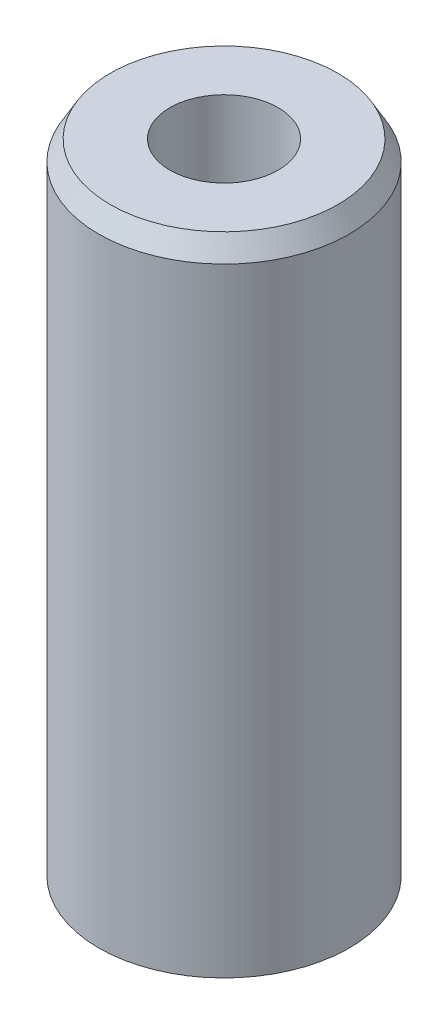
ISO-10303-21;
HEADER;
FILE_DESCRIPTION(('STEP AP214'),'2;1');
FILE_NAME('part.step','',(''),(''),'','','');
FILE_SCHEMA(('AUTOMOTIVE_DESIGN { 1 0 10303 214 1 1 1 1 }'));
ENDSEC;
DATA;
#1=APPLICATION_CONTEXT('core data for automotive mechanical design processes');
#2=APPLICATION_PROTOCOL_DEFINITION('international standard','automotive_design',2000,#1);
#3=PRODUCT_CONTEXT('',#1,'mechanical');
#4=PRODUCT('Part','Part','',(#3));
#5=PRODUCT_RELATED_PRODUCT_CATEGORY('part','',(#4));
#6=PRODUCT_DEFINITION_FORMATION('','',#4);
#7=PRODUCT_DEFINITION_CONTEXT('part definition',#1,'design');
#8=PRODUCT_DEFINITION('design','',#6,#7);
#9=PRODUCT_DEFINITION_SHAPE('','',#8);
#10=(LENGTH_UNIT() NAMED_UNIT(*) SI_UNIT(.MILLI.,.METRE.));
#11=(NAMED_UNIT(*) PLANE_ANGLE_UNIT() SI_UNIT($,.RADIAN.));
#12=(NAMED_UNIT(*) SI_UNIT($,.STERADIAN.) SOLID_ANGLE_UNIT());
#13=UNCERTAINTY_MEASURE_WITH_UNIT(LENGTH_MEASURE(1.E-05),#10,'distance_accuracy_value','');
#14=(GEOMETRIC_REPRESENTATION_CONTEXT(3) GLOBAL_UNCERTAINTY_ASSIGNED_CONTEXT((#13)) GLOBAL_UNIT_ASSIGNED_CONTEXT((#10,
#11,#12)) REPRESENTATION_CONTEXT('',''));
#15=CARTESIAN_POINT('',(0.,0.,0.));
#16=DIRECTION('',(0.,0.,1.));
#17=DIRECTION('',(1.,0.,0.));
#18=AXIS2_PLACEMENT_3D('',#15,#16,#17);
#19=CARTESIAN_POINT('',(0.,51.8531472409024,0.));
#20=DIRECTION('',(0.,-1.,0.));
#21=DIRECTION('',(0.,0.,-1.));
#22=AXIS2_PLACEMENT_3D('',#19,#20,#21);
#23=CYLINDRICAL_SURFACE('',#22,10.);
#24=CARTESIAN_POINT('',(0.,50.268366685608,0.));
#25=DIRECTION('',(0.,1.,0.));
#26=DIRECTION('',(0.,0.,1.));
#27=AXIS2_PLACEMENT_3D('',#24,#25,#26);
#28=CIRCLE('',#27,10.);
#29=CARTESIAN_POINT('',(0.,50.268366685608,10.));
#30=VERTEX_POINT('',#29);
#31=EDGE_CURVE('E50',#30,#30,#28,.F.);
#32=ORIENTED_EDGE('',*,*,#31,.T.);
#33=EDGE_LOOP('',(#32));
#34=FACE_BOUND('',#33,.T.);
#35=CARTESIAN_POINT('',(0.,0.914973480205708,0.));
#36=DIRECTION('',(0.,1.,0.));
#37=DIRECTION('',(0.,0.,1.));
#38=AXIS2_PLACEMENT_3D('',#35,#36,#37);
#39=CIRCLE('',#38,10.);
#40=CARTESIAN_POINT('',(0.,0.914973480205708,10.));
#41=VERTEX_POINT('',#40);
#42=EDGE_CURVE('E51',#41,#41,#39,.T.);
#43=ORIENTED_EDGE('',*,*,#42,.T.);
#44=EDGE_LOOP('',(#43));
#45=FACE_BOUND('',#44,.T.);
#46=ADVANCED_FACE('F39',(#34,#45),#23,.T.);
#47=CARTESIAN_POINT('',(0.,51.8531472409024,0.));
#48=DIRECTION('',(0.,1.,0.));
#49=DIRECTION('',(0.,0.,1.));
#50=AXIS2_PLACEMENT_3D('',#47,#48,#49);
#51=PLANE('',#50);
#52=CARTESIAN_POINT('',(0.,51.8531472409024,0.));
#53=DIRECTION('',(0.,1.,0.));
#54=DIRECTION('',(0.,0.,1.));
#55=AXIS2_PLACEMENT_3D('',#52,#53,#54);
#56=CIRCLE('',#55,9.0850265197943);
#57=CARTESIAN_POINT('',(0.,51.8531472409024,9.0850265197943));
#58=VERTEX_POINT('',#57);
#59=EDGE_CURVE('E54',#58,#58,#56,.T.);
#60=ORIENTED_EDGE('',*,*,#59,.T.);
#61=EDGE_LOOP('',(#60));
#62=FACE_BOUND('',#61,.T.);
#63=CARTESIAN_POINT('',(0.,51.8531472409024,0.));
#64=DIRECTION('',(0.,1.,0.));
#65=DIRECTION('',(0.,0.,1.));
#66=AXIS2_PLACEMENT_3D('',#63,#64,#65);
#67=CIRCLE('',#66,4.32339572280931);
#68=CARTESIAN_POINT('',(0.,51.8531472409024,4.32339572280931));
#69=VERTEX_POINT('',#68);
#70=EDGE_CURVE('E58',#69,#69,#67,.T.);
#71=ORIENTED_EDGE('',*,*,#70,.F.);
#72=EDGE_LOOP('',(#71));
#73=FACE_BOUND('',#72,.T.);
#74=ADVANCED_FACE('F69',(#62,#73),#51,.T.);
#75=CARTESIAN_POINT('',(0.,0.,0.));
#76=DIRECTION('',(0.,1.,0.));
#77=DIRECTION('',(0.,0.,1.));
#78=AXIS2_PLACEMENT_3D('',#75,#76,#77);
#79=PLANE('',#78);
#80=CARTESIAN_POINT('',(0.,0.,0.));
#81=DIRECTION('',(0.,1.,0.));
#82=DIRECTION('',(0.,0.,1.));
#83=AXIS2_PLACEMENT_3D('',#80,#81,#82);
#84=CIRCLE('',#83,8.41521944470559);
#85=CARTESIAN_POINT('',(0.,0.,8.41521944470559));
#86=VERTEX_POINT('',#85);
#87=EDGE_CURVE('E10',#86,#86,#84,.F.);
#88=ORIENTED_EDGE('',*,*,#87,.T.);
#89=EDGE_LOOP('',(#88));
#90=FACE_BOUND('',#89,.T.);
#91=CARTESIAN_POINT('',(0.,0.,0.));
#92=DIRECTION('',(0.,1.,0.));
#93=DIRECTION('',(0.,0.,1.));
#94=AXIS2_PLACEMENT_3D('',#91,#92,#93);
#95=CIRCLE('',#94,4.32339572280931);
#96=CARTESIAN_POINT('',(0.,0.,4.32339572280931));
#97=VERTEX_POINT('',#96);
#98=EDGE_CURVE('E63',#97,#97,#95,.T.);
#99=ORIENTED_EDGE('',*,*,#98,.T.);
#100=EDGE_LOOP('',(#99));
#101=FACE_BOUND('',#100,.T.);
#102=ADVANCED_FACE('F75',(#90,#101),#79,.F.);
#103=CARTESIAN_POINT('',(0.,51.8531472409024,0.));
#104=DIRECTION('',(0.,-1.,0.));
#105=DIRECTION('',(0.,0.,-1.));
#106=AXIS2_PLACEMENT_3D('',#103,#104,#105);
#107=CYLINDRICAL_SURFACE('',#106,4.32339572280931);
#108=ORIENTED_EDGE('',*,*,#70,.T.);
#109=EDGE_LOOP('',(#108));
#110=FACE_BOUND('',#109,.T.);
#111=ORIENTED_EDGE('',*,*,#98,.F.);
#112=EDGE_LOOP('',(#111));
#113=FACE_BOUND('',#112,.T.);
#114=ADVANCED_FACE('F70',(#110,#113),#107,.F.);
#115=CARTESIAN_POINT('',(0.,51.8531472409024,0.));
#116=DIRECTION('',(0.,-1.,0.));
#117=DIRECTION('',(0.,0.,-1.));
#118=AXIS2_PLACEMENT_3D('',#115,#116,#117);
#119=CONICAL_SURFACE('',#118,9.0850265197943,0.523598775598293);
#120=ORIENTED_EDGE('',*,*,#31,.F.);
#121=EDGE_LOOP('',(#120));
#122=FACE_BOUND('',#121,.T.);
#123=ORIENTED_EDGE('',*,*,#59,.F.);
#124=EDGE_LOOP('',(#123));
#125=FACE_BOUND('',#124,.T.);
#126=ADVANCED_FACE('F81',(#122,#125),#119,.T.);
#127=CARTESIAN_POINT('',(0.,0.914973480205708,0.));
#128=DIRECTION('',(0.,1.,0.));
#129=DIRECTION('',(0.,0.,1.));
#130=AXIS2_PLACEMENT_3D('',#127,#128,#129);
#131=CONICAL_SURFACE('',#130,10.,1.0471975511966);
#132=ORIENTED_EDGE('',*,*,#87,.F.);
#133=EDGE_LOOP('',(#132));
#134=FACE_BOUND('',#133,.T.);
#135=ORIENTED_EDGE('',*,*,#42,.F.);
#136=EDGE_LOOP('',(#135));
#137=FACE_BOUND('',#136,.T.);
#138=ADVANCED_FACE('F45',(#134,#137),#131,.T.);
#139=CLOSED_SHELL('',(#46,#74,#102,#114,#126,#138));
#140=MANIFOLD_SOLID_BREP('B2',#139);
#141=ADVANCED_BREP_SHAPE_REPRESENTATION('',(#18,#140),#14);
#142=SHAPE_DEFINITION_REPRESENTATION(#9,#141);
ENDSEC;
END-ISO-10303-21;
